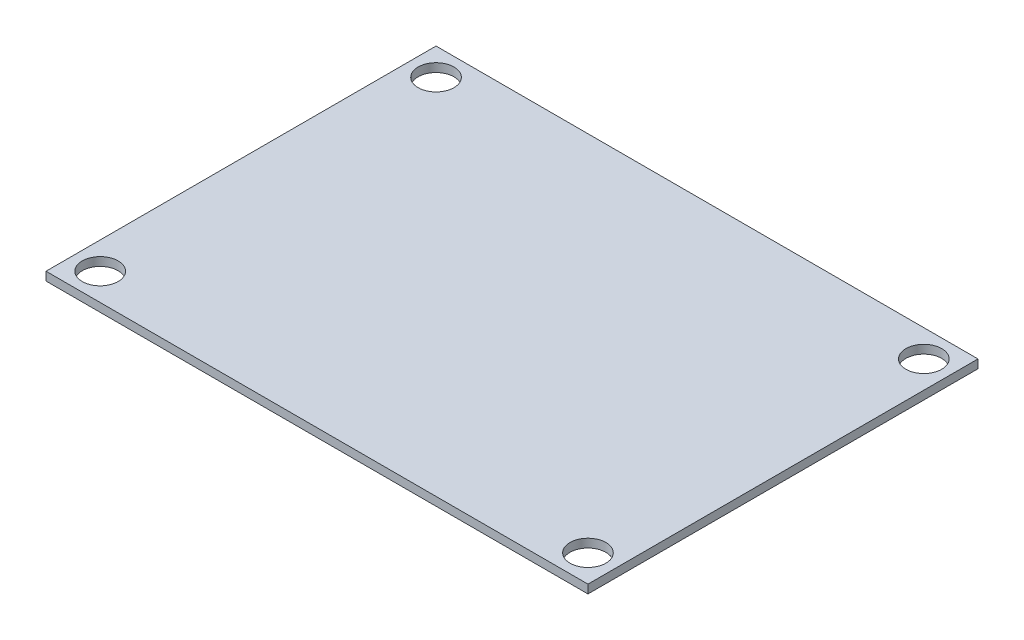
ISO-10303-21;
HEADER;
FILE_DESCRIPTION(('STEP AP214'),'2;1');
FILE_NAME('part.step','',(''),(''),'','','');
FILE_SCHEMA(('AUTOMOTIVE_DESIGN { 1 0 10303 214 1 1 1 1 }'));
ENDSEC;
DATA;
#1=APPLICATION_CONTEXT('core data for automotive mechanical design processes');
#2=APPLICATION_PROTOCOL_DEFINITION('international standard','automotive_design',2000,#1);
#3=PRODUCT_CONTEXT('',#1,'mechanical');
#4=PRODUCT('Part','Part','',(#3));
#5=PRODUCT_RELATED_PRODUCT_CATEGORY('part','',(#4));
#6=PRODUCT_DEFINITION_FORMATION('','',#4);
#7=PRODUCT_DEFINITION_CONTEXT('part definition',#1,'design');
#8=PRODUCT_DEFINITION('design','',#6,#7);
#9=PRODUCT_DEFINITION_SHAPE('','',#8);
#10=(LENGTH_UNIT() NAMED_UNIT(*) SI_UNIT(.MILLI.,.METRE.));
#11=(NAMED_UNIT(*) PLANE_ANGLE_UNIT() SI_UNIT($,.RADIAN.));
#12=(NAMED_UNIT(*) SI_UNIT($,.STERADIAN.) SOLID_ANGLE_UNIT());
#13=UNCERTAINTY_MEASURE_WITH_UNIT(LENGTH_MEASURE(1.E-05),#10,'distance_accuracy_value','');
#14=(GEOMETRIC_REPRESENTATION_CONTEXT(3) GLOBAL_UNCERTAINTY_ASSIGNED_CONTEXT((#13)) GLOBAL_UNIT_ASSIGNED_CONTEXT((#10,
#11,#12)) REPRESENTATION_CONTEXT('',''));
#15=CARTESIAN_POINT('',(0.,0.,0.));
#16=DIRECTION('',(0.,0.,1.));
#17=DIRECTION('',(1.,0.,0.));
#18=AXIS2_PLACEMENT_3D('',#15,#16,#17);
#19=CARTESIAN_POINT('',(-58.7424293485078,1.,-22.0840070963546));
#20=DIRECTION('',(1.,0.,0.));
#21=DIRECTION('',(0.,0.,-1.));
#22=AXIS2_PLACEMENT_3D('',#19,#20,#21);
#23=PLANE('',#22);
#24=DIRECTION('',(0.,0.,1.));
#25=VECTOR('',#24,1.);
#26=CARTESIAN_POINT('',(-58.7424293485078,0.,-22.0840070963546));
#27=LINE('',#26,#25);
#28=CARTESIAN_POINT('',(-58.7424293485078,0.,-22.0840070963546));
#29=VERTEX_POINT('',#28);
#30=CARTESIAN_POINT('',(-58.7424293485078,0.,23.6159929036454));
#31=VERTEX_POINT('',#30);
#32=EDGE_CURVE('E79',#29,#31,#27,.T.);
#33=ORIENTED_EDGE('',*,*,#32,.T.);
#34=DIRECTION('',(0.,-1.,0.));
#35=VECTOR('',#34,1.);
#36=CARTESIAN_POINT('',(-58.7424293485078,1.,23.6159929036454));
#37=LINE('',#36,#35);
#38=CARTESIAN_POINT('',(-58.7424293485078,1.,23.6159929036454));
#39=VERTEX_POINT('',#38);
#40=EDGE_CURVE('E10',#39,#31,#37,.T.);
#41=ORIENTED_EDGE('',*,*,#40,.F.);
#42=DIRECTION('',(0.,0.,1.));
#43=VECTOR('',#42,1.);
#44=CARTESIAN_POINT('',(-58.7424293485078,1.,-22.0840070963546));
#45=LINE('',#44,#43);
#46=CARTESIAN_POINT('',(-58.7424293485078,1.,-22.0840070963546));
#47=VERTEX_POINT('',#46);
#48=EDGE_CURVE('E67',#47,#39,#45,.T.);
#49=ORIENTED_EDGE('',*,*,#48,.F.);
#50=DIRECTION('',(0.,-1.,0.));
#51=VECTOR('',#50,1.);
#52=CARTESIAN_POINT('',(-58.7424293485078,1.,-22.0840070963546));
#53=LINE('',#52,#51);
#54=EDGE_CURVE('E75',#47,#29,#53,.T.);
#55=ORIENTED_EDGE('',*,*,#54,.T.);
#56=EDGE_LOOP('',(#33,#41,#49,#55));
#57=FACE_BOUND('',#56,.T.);
#58=ADVANCED_FACE('F16',(#57),#23,.F.);
#59=CARTESIAN_POINT('',(-58.7424293485078,1.,23.6159929036454));
#60=DIRECTION('',(0.,0.,-1.));
#61=DIRECTION('',(-1.,0.,0.));
#62=AXIS2_PLACEMENT_3D('',#59,#60,#61);
#63=PLANE('',#62);
#64=DIRECTION('',(1.,0.,0.));
#65=VECTOR('',#64,1.);
#66=CARTESIAN_POINT('',(-58.7424293485078,0.,23.6159929036454));
#67=LINE('',#66,#65);
#68=CARTESIAN_POINT('',(4.75757065149224,0.,23.6159929036454));
#69=VERTEX_POINT('',#68);
#70=EDGE_CURVE('E71',#31,#69,#67,.T.);
#71=ORIENTED_EDGE('',*,*,#70,.T.);
#72=DIRECTION('',(0.,-1.,0.));
#73=VECTOR('',#72,1.);
#74=CARTESIAN_POINT('',(4.75757065149224,1.,23.6159929036454));
#75=LINE('',#74,#73);
#76=CARTESIAN_POINT('',(4.75757065149224,1.,23.6159929036454));
#77=VERTEX_POINT('',#76);
#78=EDGE_CURVE('E24',#77,#69,#75,.T.);
#79=ORIENTED_EDGE('',*,*,#78,.F.);
#80=DIRECTION('',(1.,0.,0.));
#81=VECTOR('',#80,1.);
#82=CARTESIAN_POINT('',(-58.7424293485078,1.,23.6159929036454));
#83=LINE('',#82,#81);
#84=EDGE_CURVE('E62',#39,#77,#83,.T.);
#85=ORIENTED_EDGE('',*,*,#84,.F.);
#86=ORIENTED_EDGE('',*,*,#40,.T.);
#87=EDGE_LOOP('',(#71,#79,#85,#86));
#88=FACE_BOUND('',#87,.T.);
#89=ADVANCED_FACE('F70',(#88),#63,.F.);
#90=CARTESIAN_POINT('',(4.75757065149223,1.,-22.0840070963546));
#91=DIRECTION('',(-1.,0.,0.));
#92=DIRECTION('',(0.,0.,1.));
#93=AXIS2_PLACEMENT_3D('',#90,#91,#92);
#94=PLANE('',#93);
#95=DIRECTION('',(0.,0.,-1.));
#96=VECTOR('',#95,1.);
#97=CARTESIAN_POINT('',(4.75757065149223,0.,-22.0840070963546));
#98=LINE('',#97,#96);
#99=CARTESIAN_POINT('',(4.75757065149223,0.,-22.0840070963546));
#100=VERTEX_POINT('',#99);
#101=EDGE_CURVE('E49',#69,#100,#98,.T.);
#102=ORIENTED_EDGE('',*,*,#101,.T.);
#103=DIRECTION('',(0.,-1.,0.));
#104=VECTOR('',#103,1.);
#105=CARTESIAN_POINT('',(4.75757065149223,1.,-22.0840070963546));
#106=LINE('',#105,#104);
#107=CARTESIAN_POINT('',(4.75757065149223,1.,-22.0840070963546));
#108=VERTEX_POINT('',#107);
#109=EDGE_CURVE('E72',#108,#100,#106,.T.);
#110=ORIENTED_EDGE('',*,*,#109,.F.);
#111=DIRECTION('',(0.,0.,-1.));
#112=VECTOR('',#111,1.);
#113=CARTESIAN_POINT('',(4.75757065149223,1.,-22.0840070963546));
#114=LINE('',#113,#112);
#115=EDGE_CURVE('E65',#77,#108,#114,.T.);
#116=ORIENTED_EDGE('',*,*,#115,.F.);
#117=ORIENTED_EDGE('',*,*,#78,.T.);
#118=EDGE_LOOP('',(#102,#110,#116,#117));
#119=FACE_BOUND('',#118,.T.);
#120=ADVANCED_FACE('F73',(#119),#94,.F.);
#121=CARTESIAN_POINT('',(-58.7424293485078,1.,-22.0840070963546));
#122=DIRECTION('',(0.,0.,1.));
#123=DIRECTION('',(1.,0.,0.));
#124=AXIS2_PLACEMENT_3D('',#121,#122,#123);
#125=PLANE('',#124);
#126=DIRECTION('',(-1.,0.,0.));
#127=VECTOR('',#126,1.);
#128=CARTESIAN_POINT('',(-58.7424293485078,0.,-22.0840070963546));
#129=LINE('',#128,#127);
#130=EDGE_CURVE('E55',#100,#29,#129,.T.);
#131=ORIENTED_EDGE('',*,*,#130,.T.);
#132=ORIENTED_EDGE('',*,*,#54,.F.);
#133=DIRECTION('',(-1.,0.,0.));
#134=VECTOR('',#133,1.);
#135=CARTESIAN_POINT('',(-58.7424293485078,1.,-22.0840070963546));
#136=LINE('',#135,#134);
#137=EDGE_CURVE('E32',#108,#47,#136,.T.);
#138=ORIENTED_EDGE('',*,*,#137,.F.);
#139=ORIENTED_EDGE('',*,*,#109,.T.);
#140=EDGE_LOOP('',(#131,#132,#138,#139));
#141=FACE_BOUND('',#140,.T.);
#142=ADVANCED_FACE('F87',(#141),#125,.F.);
#143=CARTESIAN_POINT('',(0.,1.,0.));
#144=DIRECTION('',(0.,1.,0.));
#145=DIRECTION('',(0.,0.,1.));
#146=AXIS2_PLACEMENT_3D('',#143,#144,#145);
#147=PLANE('',#146);
#148=CARTESIAN_POINT('',(-55.5674293485078,1.,20.4409929006507));
#149=DIRECTION('',(0.,1.,0.));
#150=DIRECTION('',(0.,0.,1.));
#151=AXIS2_PLACEMENT_3D('',#148,#149,#150);
#152=CIRCLE('',#151,2.09999999999999);
#153=CARTESIAN_POINT('',(-55.5674293485078,1.,22.5409929006507));
#154=VERTEX_POINT('',#153);
#155=EDGE_CURVE('E113',#154,#154,#152,.T.);
#156=ORIENTED_EDGE('',*,*,#155,.F.);
#157=EDGE_LOOP('',(#156));
#158=FACE_BOUND('',#157,.T.);
#159=CARTESIAN_POINT('',(-55.5674293485077,1.,-18.9090070993493));
#160=DIRECTION('',(0.,1.,0.));
#161=DIRECTION('',(0.,0.,1.));
#162=AXIS2_PLACEMENT_3D('',#159,#160,#161);
#163=CIRCLE('',#162,2.09999999999998);
#164=CARTESIAN_POINT('',(-55.5674293485077,1.,-16.8090070993493));
#165=VERTEX_POINT('',#164);
#166=EDGE_CURVE('E107',#165,#165,#163,.T.);
#167=ORIENTED_EDGE('',*,*,#166,.F.);
#168=EDGE_LOOP('',(#167));
#169=FACE_BOUND('',#168,.T.);
#170=CARTESIAN_POINT('',(1.58257065149225,1.,-18.9090070993493));
#171=DIRECTION('',(0.,1.,0.));
#172=DIRECTION('',(0.,0.,1.));
#173=AXIS2_PLACEMENT_3D('',#170,#171,#172);
#174=CIRCLE('',#173,2.09999999999999);
#175=CARTESIAN_POINT('',(1.58257065149225,1.,-16.8090070993493));
#176=VERTEX_POINT('',#175);
#177=EDGE_CURVE('E101',#176,#176,#174,.T.);
#178=ORIENTED_EDGE('',*,*,#177,.F.);
#179=EDGE_LOOP('',(#178));
#180=FACE_BOUND('',#179,.T.);
#181=CARTESIAN_POINT('',(1.58257065149225,1.,20.4409929006507));
#182=DIRECTION('',(0.,1.,0.));
#183=DIRECTION('',(0.,0.,1.));
#184=AXIS2_PLACEMENT_3D('',#181,#182,#183);
#185=CIRCLE('',#184,2.09999999999999);
#186=CARTESIAN_POINT('',(1.58257065149225,1.,22.5409929006507));
#187=VERTEX_POINT('',#186);
#188=EDGE_CURVE('E95',#187,#187,#185,.T.);
#189=ORIENTED_EDGE('',*,*,#188,.F.);
#190=EDGE_LOOP('',(#189));
#191=FACE_BOUND('',#190,.T.);
#192=ORIENTED_EDGE('',*,*,#48,.T.);
#193=ORIENTED_EDGE('',*,*,#84,.T.);
#194=ORIENTED_EDGE('',*,*,#115,.T.);
#195=ORIENTED_EDGE('',*,*,#137,.T.);
#196=EDGE_LOOP('',(#192,#193,#194,#195));
#197=FACE_BOUND('',#196,.T.);
#198=ADVANCED_FACE('F63',(#158,#169,#180,#191,#197),#147,.T.);
#199=CARTESIAN_POINT('',(0.,0.,0.));
#200=DIRECTION('',(0.,1.,0.));
#201=DIRECTION('',(0.,0.,1.));
#202=AXIS2_PLACEMENT_3D('',#199,#200,#201);
#203=PLANE('',#202);
#204=CARTESIAN_POINT('',(-55.5674293485078,0.,20.4409929006507));
#205=DIRECTION('',(0.,1.,0.));
#206=DIRECTION('',(0.,0.,1.));
#207=AXIS2_PLACEMENT_3D('',#204,#205,#206);
#208=CIRCLE('',#207,2.1);
#209=CARTESIAN_POINT('',(-55.5674293485078,0.,22.5409929006507));
#210=VERTEX_POINT('',#209);
#211=EDGE_CURVE('E110',#210,#210,#208,.T.);
#212=ORIENTED_EDGE('',*,*,#211,.T.);
#213=EDGE_LOOP('',(#212));
#214=FACE_BOUND('',#213,.T.);
#215=CARTESIAN_POINT('',(-55.5674293485077,0.,-18.9090070993493));
#216=DIRECTION('',(0.,1.,0.));
#217=DIRECTION('',(0.,0.,1.));
#218=AXIS2_PLACEMENT_3D('',#215,#216,#217);
#219=CIRCLE('',#218,2.1);
#220=CARTESIAN_POINT('',(-55.5674293485077,0.,-16.8090070993493));
#221=VERTEX_POINT('',#220);
#222=EDGE_CURVE('E104',#221,#221,#219,.T.);
#223=ORIENTED_EDGE('',*,*,#222,.T.);
#224=EDGE_LOOP('',(#223));
#225=FACE_BOUND('',#224,.T.);
#226=CARTESIAN_POINT('',(1.58257065149225,0.,-18.9090070993493));
#227=DIRECTION('',(0.,1.,0.));
#228=DIRECTION('',(0.,0.,1.));
#229=AXIS2_PLACEMENT_3D('',#226,#227,#228);
#230=CIRCLE('',#229,2.1);
#231=CARTESIAN_POINT('',(1.58257065149225,0.,-16.8090070993493));
#232=VERTEX_POINT('',#231);
#233=EDGE_CURVE('E98',#232,#232,#230,.T.);
#234=ORIENTED_EDGE('',*,*,#233,.T.);
#235=EDGE_LOOP('',(#234));
#236=FACE_BOUND('',#235,.T.);
#237=CARTESIAN_POINT('',(1.58257065149225,0.,20.4409929006507));
#238=DIRECTION('',(0.,1.,0.));
#239=DIRECTION('',(0.,0.,1.));
#240=AXIS2_PLACEMENT_3D('',#237,#238,#239);
#241=CIRCLE('',#240,2.1);
#242=CARTESIAN_POINT('',(1.58257065149225,0.,22.5409929006507));
#243=VERTEX_POINT('',#242);
#244=EDGE_CURVE('E82',#243,#243,#241,.T.);
#245=ORIENTED_EDGE('',*,*,#244,.T.);
#246=EDGE_LOOP('',(#245));
#247=FACE_BOUND('',#246,.T.);
#248=ORIENTED_EDGE('',*,*,#32,.F.);
#249=ORIENTED_EDGE('',*,*,#130,.F.);
#250=ORIENTED_EDGE('',*,*,#101,.F.);
#251=ORIENTED_EDGE('',*,*,#70,.F.);
#252=EDGE_LOOP('',(#248,#249,#250,#251));
#253=FACE_BOUND('',#252,.T.);
#254=ADVANCED_FACE('F90',(#214,#225,#236,#247,#253),#203,.F.);
#255=CARTESIAN_POINT('',(1.58257065149225,1.,20.4409929006507));
#256=DIRECTION('',(0.,1.,0.));
#257=DIRECTION('',(0.,0.,1.));
#258=AXIS2_PLACEMENT_3D('',#255,#256,#257);
#259=CYLINDRICAL_SURFACE('',#258,2.09999999999999);
#260=ORIENTED_EDGE('',*,*,#244,.F.);
#261=EDGE_LOOP('',(#260));
#262=FACE_BOUND('',#261,.T.);
#263=ORIENTED_EDGE('',*,*,#188,.T.);
#264=EDGE_LOOP('',(#263));
#265=FACE_BOUND('',#264,.T.);
#266=ADVANCED_FACE('F128',(#262,#265),#259,.F.);
#267=CARTESIAN_POINT('',(1.58257065149225,1.,-18.9090070993493));
#268=DIRECTION('',(0.,1.,0.));
#269=DIRECTION('',(0.,0.,1.));
#270=AXIS2_PLACEMENT_3D('',#267,#268,#269);
#271=CYLINDRICAL_SURFACE('',#270,2.09999999999999);
#272=ORIENTED_EDGE('',*,*,#233,.F.);
#273=EDGE_LOOP('',(#272));
#274=FACE_BOUND('',#273,.T.);
#275=ORIENTED_EDGE('',*,*,#177,.T.);
#276=EDGE_LOOP('',(#275));
#277=FACE_BOUND('',#276,.T.);
#278=ADVANCED_FACE('F130',(#274,#277),#271,.F.);
#279=CARTESIAN_POINT('',(-55.5674293485077,1.,-18.9090070993493));
#280=DIRECTION('',(0.,1.,0.));
#281=DIRECTION('',(0.,0.,1.));
#282=AXIS2_PLACEMENT_3D('',#279,#280,#281);
#283=CYLINDRICAL_SURFACE('',#282,2.09999999999999);
#284=ORIENTED_EDGE('',*,*,#222,.F.);
#285=EDGE_LOOP('',(#284));
#286=FACE_BOUND('',#285,.T.);
#287=ORIENTED_EDGE('',*,*,#166,.T.);
#288=EDGE_LOOP('',(#287));
#289=FACE_BOUND('',#288,.T.);
#290=ADVANCED_FACE('F138',(#286,#289),#283,.F.);
#291=CARTESIAN_POINT('',(-55.5674293485078,1.,20.4409929006507));
#292=DIRECTION('',(0.,1.,0.));
#293=DIRECTION('',(0.,0.,1.));
#294=AXIS2_PLACEMENT_3D('',#291,#292,#293);
#295=CYLINDRICAL_SURFACE('',#294,2.09999999999999);
#296=ORIENTED_EDGE('',*,*,#211,.F.);
#297=EDGE_LOOP('',(#296));
#298=FACE_BOUND('',#297,.T.);
#299=ORIENTED_EDGE('',*,*,#155,.T.);
#300=EDGE_LOOP('',(#299));
#301=FACE_BOUND('',#300,.T.);
#302=ADVANCED_FACE('F117',(#298,#301),#295,.F.);
#303=CLOSED_SHELL('',(#58,#89,#120,#142,#198,#254,#266,#278,#290,#302));
#304=MANIFOLD_SOLID_BREP('B1',#303);
#305=ADVANCED_BREP_SHAPE_REPRESENTATION('',(#18,#304),#14);
#306=SHAPE_DEFINITION_REPRESENTATION(#9,#305);
ENDSEC;
END-ISO-10303-21;
